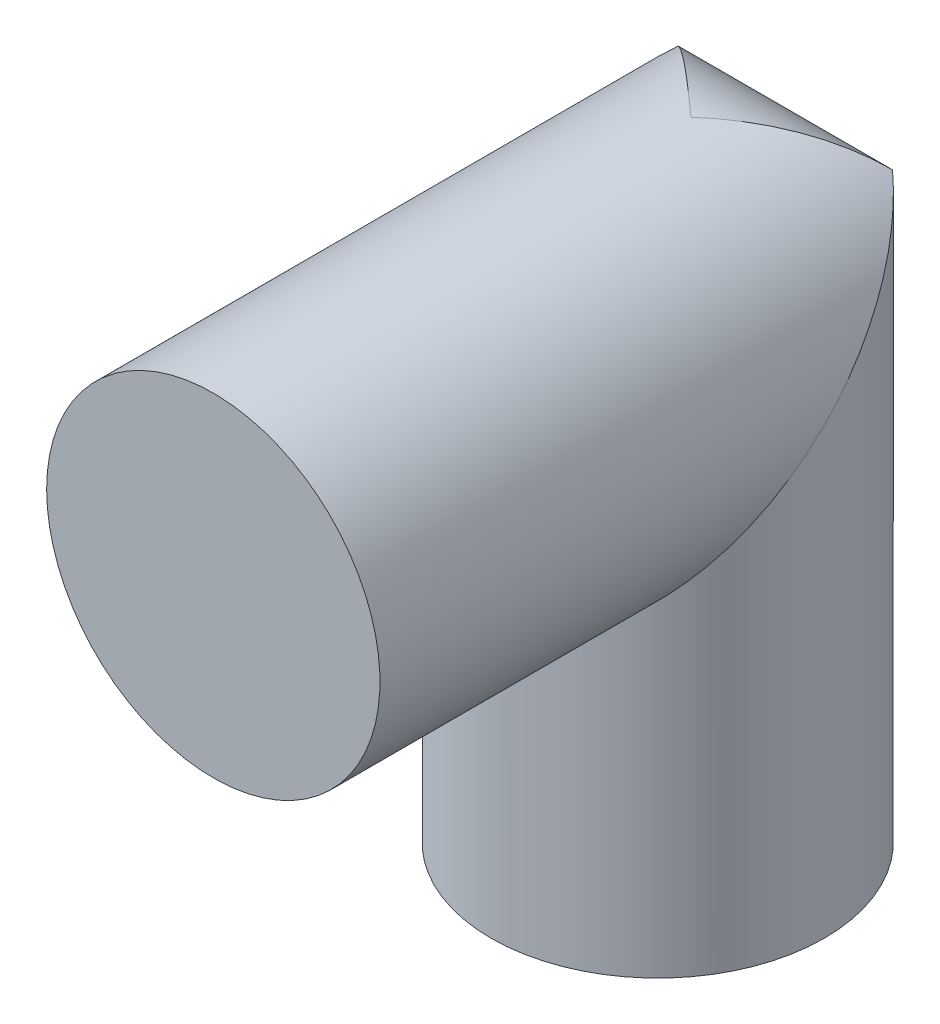
ISO-10303-21;
HEADER;
FILE_DESCRIPTION(('STEP AP214'),'2;1');
FILE_NAME('part.step','',(''),(''),'','','');
FILE_SCHEMA(('AUTOMOTIVE_DESIGN { 1 0 10303 214 1 1 1 1 }'));
ENDSEC;
DATA;
#1=APPLICATION_CONTEXT('core data for automotive mechanical design processes');
#2=APPLICATION_PROTOCOL_DEFINITION('international standard','automotive_design',2000,#1);
#3=PRODUCT_CONTEXT('',#1,'mechanical');
#4=PRODUCT('Part','Part','',(#3));
#5=PRODUCT_RELATED_PRODUCT_CATEGORY('part','',(#4));
#6=PRODUCT_DEFINITION_FORMATION('','',#4);
#7=PRODUCT_DEFINITION_CONTEXT('part definition',#1,'design');
#8=PRODUCT_DEFINITION('design','',#6,#7);
#9=PRODUCT_DEFINITION_SHAPE('','',#8);
#10=(LENGTH_UNIT() NAMED_UNIT(*) SI_UNIT(.MILLI.,.METRE.));
#11=(NAMED_UNIT(*) PLANE_ANGLE_UNIT() SI_UNIT($,.RADIAN.));
#12=(NAMED_UNIT(*) SI_UNIT($,.STERADIAN.) SOLID_ANGLE_UNIT());
#13=UNCERTAINTY_MEASURE_WITH_UNIT(LENGTH_MEASURE(1.E-05),#10,'distance_accuracy_value','');
#14=(GEOMETRIC_REPRESENTATION_CONTEXT(3) GLOBAL_UNCERTAINTY_ASSIGNED_CONTEXT((#13)) GLOBAL_UNIT_ASSIGNED_CONTEXT((#10,
#11,#12)) REPRESENTATION_CONTEXT('',''));
#15=CARTESIAN_POINT('',(0.,0.,0.));
#16=DIRECTION('',(0.,0.,1.));
#17=DIRECTION('',(1.,0.,0.));
#18=AXIS2_PLACEMENT_3D('',#15,#16,#17);
#19=CARTESIAN_POINT('',(0.,21.5,-1.5));
#20=DIRECTION('',(-1.,0.,0.));
#21=DIRECTION('',(0.,0.,-1.));
#22=AXIS2_PLACEMENT_3D('',#19,#20,#21);
#23=CYLINDRICAL_SURFACE('',#22,6.);
#24=CARTESIAN_POINT('',(-7.34846922834953,27.5,-1.5));
#25=CARTESIAN_POINT('',(-7.31706424320828,27.5000331957549,-1.65405077419429));
#26=CARTESIAN_POINT('',(-7.28075194110682,27.4940693668532,-1.80703711580767));
#27=CARTESIAN_POINT('',(-7.19892176468412,27.4708798561574,-2.10947278347154));
#28=CARTESIAN_POINT('',(-7.15341480555609,27.45366747415,-2.25892607088523));
#29=CARTESIAN_POINT('',(-7.05418509725385,27.4089160579525,-2.55190609071861));
#30=CARTESIAN_POINT('',(-7.00054159376687,27.3814732609108,-2.69547463052301));
#31=CARTESIAN_POINT('',(-6.88542259652419,27.3170929655942,-2.97726707911698));
#32=CARTESIAN_POINT('',(-6.82394500325097,27.2801529193687,-3.11548954217873));
#33=CARTESIAN_POINT('',(-6.6942220814402,27.1978725359462,-3.38521497082394));
#34=CARTESIAN_POINT('',(-6.62601154961609,27.152574435804,-3.51674765868404));
#35=CARTESIAN_POINT('',(-6.4832859756266,27.0543249800231,-3.77340449367048));
#36=CARTESIAN_POINT('',(-6.40876873452205,27.0013709504214,-3.89852638095057));
#37=CARTESIAN_POINT('',(-6.17651896919774,26.8320737340819,-4.264282989696));
#38=CARTESIAN_POINT('',(-6.01031740131606,26.7054434095421,-4.49484023103864));
#39=CARTESIAN_POINT('',(-5.56725801293658,26.3577363930378,-5.04359779603737));
#40=CARTESIAN_POINT('',(-5.27857768732249,26.1222582745337,-5.34315292990793));
#41=CARTESIAN_POINT('',(-4.82535938390804,25.7441211948374,-5.7451644420547));
#42=CARTESIAN_POINT('',(-4.67067303979472,25.6137077577687,-5.87143511792813));
#43=CARTESIAN_POINT('',(-4.35565867931801,25.3459342113691,-6.10877087768909));
#44=CARTESIAN_POINT('',(-4.19533069401521,25.2085741402817,-6.21983604527555));
#45=CARTESIAN_POINT('',(-3.80972447054179,24.8761643468941,-6.46575611994799));
#46=CARTESIAN_POINT('',(-3.58244270484609,24.6786388710023,-6.59412244217131));
#47=CARTESIAN_POINT('',(-3.12151583544015,24.275707309497,-6.82440727984441));
#48=CARTESIAN_POINT('',(-2.88786843379676,24.0702983667924,-6.92631610078327));
#49=CARTESIAN_POINT('',(-2.4162110566506,23.653977718259,-7.10460478297199));
#50=CARTESIAN_POINT('',(-2.17820522234088,23.4430711627534,-7.18100767347115));
#51=CARTESIAN_POINT('',(-1.69917689146743,23.0174626863675,-7.30919273707965));
#52=CARTESIAN_POINT('',(-1.458154709178,22.8027611599409,-7.36097745360345));
#53=CARTESIAN_POINT('',(-0.816756950161567,22.2305245219006,-7.46636698368148));
#54=CARTESIAN_POINT('',(-0.414581874794828,21.8708132487053,-7.4992978008994));
#55=CARTESIAN_POINT('',(-0.00860657087966011,21.5076979505281,-7.49999629295744));
#56=CARTESIAN_POINT('',(-0.00430325450511151,21.5038489473343,-7.49999999648203));
#57=CARTESIAN_POINT('',(0.,21.5,-7.5));
#58=B_SPLINE_CURVE_WITH_KNOTS('',3,(#24,#25,#26,#27,#28,#29,#30,#31,#32,#33,#34,#35,#36,#37,#38,
#39,#40,#41,#42,#43,#44,#45,#46,#47,#48,#49,#50,#51,#52,#53,#54,#55,#56,#57),.UNSPECIFIED.,.F.,
.F.,(4,2,2,2,2,2,2,2,2,2,2,2,2,2,2,2,4),(0.,0.471373590474039,0.942190855766601,
1.40868655153159,1.8753075310081,2.33963201979185,2.80411907530698,3.73470291513999,
5.16046403165904,5.87549295654269,6.59051794538261,7.57115182108864,8.55214451340354,
9.53224905871671,10.5122523229959,12.1289287099927,12.1462492216324),.UNSPECIFIED.);
#59=CARTESIAN_POINT('',(-4.82411421285216,25.7426406871193,-5.74264068711928));
#60=VERTEX_POINT('',#59);
#61=CARTESIAN_POINT('',(0.,21.5,-7.5));
#62=VERTEX_POINT('',#61);
#63=EDGE_CURVE('E76',#60,#62,#58,.T.);
#64=ORIENTED_EDGE('',*,*,#63,.F.);
#65=CARTESIAN_POINT('',(-7.34846922834954,21.5,-7.5));
#66=CARTESIAN_POINT('',(-7.31706424320828,21.6540507741943,-7.50003319575489));
#67=CARTESIAN_POINT('',(-7.28075194110682,21.8070371158077,-7.49406936685315));
#68=CARTESIAN_POINT('',(-7.19892176468412,22.1094727834715,-7.47087985615743));
#69=CARTESIAN_POINT('',(-7.15341480555609,22.2589260708852,-7.45366747414996));
#70=CARTESIAN_POINT('',(-7.05418509725386,22.5519060907186,-7.40891605795252));
#71=CARTESIAN_POINT('',(-7.00054159376687,22.695474630523,-7.38147326091079));
#72=CARTESIAN_POINT('',(-6.88542259652419,22.977267079117,-7.31709296559424));
#73=CARTESIAN_POINT('',(-6.82394500325097,23.1154895421787,-7.2801529193687));
#74=CARTESIAN_POINT('',(-6.69422208144019,23.3852149708239,-7.19787253594618));
#75=CARTESIAN_POINT('',(-6.62601154961609,23.516747658684,-7.15257443580398));
#76=CARTESIAN_POINT('',(-6.48328597562659,23.7734044936705,-7.0543249800231));
#77=CARTESIAN_POINT('',(-6.40876873452205,23.8985263809506,-7.00137095042142));
#78=CARTESIAN_POINT('',(-6.17651896919773,24.264282989696,-6.83207373408186));
#79=CARTESIAN_POINT('',(-6.01031740131606,24.4948402310386,-6.70544340954208));
#80=CARTESIAN_POINT('',(-5.56725801293659,25.0435977960374,-6.35773639303777));
#81=CARTESIAN_POINT('',(-5.2785776873225,25.3431529299079,-6.12225827453367));
#82=CARTESIAN_POINT('',(-4.82535938390806,25.7451644420547,-5.74412119483743));
#83=CARTESIAN_POINT('',(-4.67067303979474,25.8714351179281,-5.61370775776872));
#84=CARTESIAN_POINT('',(-4.35565867931802,26.1087708776891,-5.34593421136909));
#85=CARTESIAN_POINT('',(-4.19533069401521,26.2198360452755,-5.20857414028169));
#86=CARTESIAN_POINT('',(-3.80972447054179,26.465756119948,-4.87616434689405));
#87=CARTESIAN_POINT('',(-3.58244270484611,26.5941224421713,-4.67863887100232));
#88=CARTESIAN_POINT('',(-3.12151583544012,26.8244072798444,-4.275707309497));
#89=CARTESIAN_POINT('',(-2.88786843379666,26.9263161007833,-4.07029836679249));
#90=CARTESIAN_POINT('',(-2.41621105665066,27.104604782972,-3.65397771825885));
#91=CARTESIAN_POINT('',(-2.17820522234116,27.1810076734712,-3.44307116275308));
#92=CARTESIAN_POINT('',(-1.69917689146713,27.3091927370797,-3.01746268636787));
#93=CARTESIAN_POINT('',(-1.45815470917688,27.3609774536035,-2.80276115994216));
#94=CARTESIAN_POINT('',(-0.81675695016343,27.4663669836815,-2.23052452189857));
#95=CARTESIAN_POINT('',(-0.414581874803825,27.4992978008993,-1.87081324869521));
#96=CARTESIAN_POINT('',(-0.00860657087985405,27.4999962929574,-1.50769795052791));
#97=CARTESIAN_POINT('',(-0.00430325450520941,27.499999996482,-1.50384894733419));
#98=CARTESIAN_POINT('',(0.,27.5,-1.5));
#99=B_SPLINE_CURVE_WITH_KNOTS('',3,(#65,#66,#67,#68,#69,#70,#71,#72,#73,#74,#75,#76,#77,#78,#79,
#80,#81,#82,#83,#84,#85,#86,#87,#88,#89,#90,#91,#92,#93,#94,#95,#96,#97,#98),.UNSPECIFIED.,.F.,
.F.,(4,2,2,2,2,2,2,2,2,2,2,2,2,2,2,2,4),(0.,0.471373590474027,0.942190855766583,
1.40868655153158,1.8753075310081,2.33963201979186,2.80411907530699,3.73470291513999,
5.16046403165901,5.87549295654268,6.59051794538261,7.57115182108865,8.55214451340358,
9.53224905871674,10.5122523229959,12.1289287099927,12.1462492216324),.UNSPECIFIED.);
#100=CARTESIAN_POINT('',(0.,27.5,-1.5));
#101=VERTEX_POINT('',#100);
#102=EDGE_CURVE('E65',#101,#60,#99,.F.);
#103=ORIENTED_EDGE('',*,*,#102,.F.);
#104=CARTESIAN_POINT('',(7.34846922834954,21.5,-7.5));
#105=CARTESIAN_POINT('',(7.31706424320828,21.6540507741943,-7.50003319575489));
#106=CARTESIAN_POINT('',(7.28075194110682,21.8070371158077,-7.49406936685315));
#107=CARTESIAN_POINT('',(7.19892176468412,22.1094727834715,-7.47087985615743));
#108=CARTESIAN_POINT('',(7.15341480555609,22.2589260708852,-7.45366747414996));
#109=CARTESIAN_POINT('',(7.05418509725386,22.5519060907186,-7.40891605795252));
#110=CARTESIAN_POINT('',(7.00054159376687,22.695474630523,-7.38147326091079));
#111=CARTESIAN_POINT('',(6.88542259652419,22.977267079117,-7.31709296559424));
#112=CARTESIAN_POINT('',(6.82394500325097,23.1154895421787,-7.2801529193687));
#113=CARTESIAN_POINT('',(6.69422208144019,23.3852149708239,-7.19787253594618));
#114=CARTESIAN_POINT('',(6.62601154961609,23.516747658684,-7.15257443580398));
#115=CARTESIAN_POINT('',(6.48328597562659,23.7734044936705,-7.0543249800231));
#116=CARTESIAN_POINT('',(6.40876873452205,23.8985263809506,-7.00137095042142));
#117=CARTESIAN_POINT('',(6.17651896919773,24.264282989696,-6.83207373408186));
#118=CARTESIAN_POINT('',(6.01031740131606,24.4948402310386,-6.70544340954208));
#119=CARTESIAN_POINT('',(5.56725801293659,25.0435977960374,-6.35773639303777));
#120=CARTESIAN_POINT('',(5.2785776873225,25.3431529299079,-6.12225827453367));
#121=CARTESIAN_POINT('',(4.82535938390806,25.7451644420547,-5.74412119483743));
#122=CARTESIAN_POINT('',(4.67067303979474,25.8714351179281,-5.61370775776872));
#123=CARTESIAN_POINT('',(4.35565867931802,26.1087708776891,-5.34593421136909));
#124=CARTESIAN_POINT('',(4.19533069401521,26.2198360452755,-5.20857414028169));
#125=CARTESIAN_POINT('',(3.80972447054179,26.465756119948,-4.87616434689405));
#126=CARTESIAN_POINT('',(3.58244270484611,26.5941224421713,-4.67863887100232));
#127=CARTESIAN_POINT('',(3.12151583544012,26.8244072798444,-4.275707309497));
#128=CARTESIAN_POINT('',(2.88786843379666,26.9263161007833,-4.07029836679249));
#129=CARTESIAN_POINT('',(2.41621105665066,27.104604782972,-3.65397771825885));
#130=CARTESIAN_POINT('',(2.17820522234116,27.1810076734712,-3.44307116275308));
#131=CARTESIAN_POINT('',(1.69917689146713,27.3091927370797,-3.01746268636787));
#132=CARTESIAN_POINT('',(1.45815470917688,27.3609774536035,-2.80276115994216));
#133=CARTESIAN_POINT('',(0.81675695016343,27.4663669836815,-2.23052452189857));
#134=CARTESIAN_POINT('',(0.414581874803825,27.4992978008993,-1.87081324869521));
#135=CARTESIAN_POINT('',(0.00860657087985405,27.4999962929574,-1.50769795052791));
#136=CARTESIAN_POINT('',(0.00430325450520941,27.499999996482,-1.50384894733419));
#137=CARTESIAN_POINT('',(0.,27.5,-1.5));
#138=B_SPLINE_CURVE_WITH_KNOTS('',3,(#104,#105,#106,#107,#108,#109,#110,#111,#112,#113,#114,
#115,#116,#117,#118,#119,#120,#121,#122,#123,#124,#125,#126,#127,#128,#129,#130,#131,#132,#133,
#134,#135,#136,#137),.UNSPECIFIED.,.F.,.F.,(4,2,2,2,2,2,2,2,2,2,2,2,2,2,2,2,4),(0.,
0.471373590474027,0.942190855766583,1.40868655153158,1.8753075310081,2.33963201979186,
2.80411907530699,3.73470291513999,5.16046403165901,5.87549295654268,6.59051794538261,
7.57115182108865,8.55214451340358,9.53224905871674,10.5122523229959,12.1289287099927,
12.1462492216324),.UNSPECIFIED.);
#139=CARTESIAN_POINT('',(4.82411421285216,25.7426406871193,-5.74264068711928));
#140=VERTEX_POINT('',#139);
#141=EDGE_CURVE('E39',#101,#140,#138,.F.);
#142=ORIENTED_EDGE('',*,*,#141,.T.);
#143=CARTESIAN_POINT('',(7.34846922834953,27.5,-1.5));
#144=CARTESIAN_POINT('',(7.31706424320828,27.5000331957549,-1.65405077419429));
#145=CARTESIAN_POINT('',(7.28075194110682,27.4940693668532,-1.80703711580767));
#146=CARTESIAN_POINT('',(7.19892176468412,27.4708798561574,-2.10947278347154));
#147=CARTESIAN_POINT('',(7.15341480555609,27.45366747415,-2.25892607088523));
#148=CARTESIAN_POINT('',(7.05418509725385,27.4089160579525,-2.55190609071861));
#149=CARTESIAN_POINT('',(7.00054159376687,27.3814732609108,-2.69547463052301));
#150=CARTESIAN_POINT('',(6.88542259652419,27.3170929655942,-2.97726707911698));
#151=CARTESIAN_POINT('',(6.82394500325097,27.2801529193687,-3.11548954217873));
#152=CARTESIAN_POINT('',(6.6942220814402,27.1978725359462,-3.38521497082394));
#153=CARTESIAN_POINT('',(6.62601154961609,27.152574435804,-3.51674765868404));
#154=CARTESIAN_POINT('',(6.4832859756266,27.0543249800231,-3.77340449367048));
#155=CARTESIAN_POINT('',(6.40876873452205,27.0013709504214,-3.89852638095057));
#156=CARTESIAN_POINT('',(6.17651896919774,26.8320737340819,-4.264282989696));
#157=CARTESIAN_POINT('',(6.01031740131606,26.7054434095421,-4.49484023103864));
#158=CARTESIAN_POINT('',(5.56725801293658,26.3577363930378,-5.04359779603737));
#159=CARTESIAN_POINT('',(5.27857768732249,26.1222582745337,-5.34315292990793));
#160=CARTESIAN_POINT('',(4.82535938390804,25.7441211948374,-5.7451644420547));
#161=CARTESIAN_POINT('',(4.67067303979472,25.6137077577687,-5.87143511792813));
#162=CARTESIAN_POINT('',(4.35565867931801,25.3459342113691,-6.10877087768909));
#163=CARTESIAN_POINT('',(4.19533069401521,25.2085741402817,-6.21983604527555));
#164=CARTESIAN_POINT('',(3.80972447054179,24.8761643468941,-6.46575611994799));
#165=CARTESIAN_POINT('',(3.58244270484609,24.6786388710023,-6.59412244217131));
#166=CARTESIAN_POINT('',(3.12151583544015,24.275707309497,-6.82440727984441));
#167=CARTESIAN_POINT('',(2.88786843379676,24.0702983667924,-6.92631610078327));
#168=CARTESIAN_POINT('',(2.4162110566506,23.653977718259,-7.10460478297199));
#169=CARTESIAN_POINT('',(2.17820522234088,23.4430711627534,-7.18100767347115));
#170=CARTESIAN_POINT('',(1.69917689146743,23.0174626863675,-7.30919273707965));
#171=CARTESIAN_POINT('',(1.458154709178,22.8027611599409,-7.36097745360345));
#172=CARTESIAN_POINT('',(0.816756950161567,22.2305245219006,-7.46636698368148));
#173=CARTESIAN_POINT('',(0.414581874794828,21.8708132487053,-7.4992978008994));
#174=CARTESIAN_POINT('',(0.00860657087966011,21.5076979505281,-7.49999629295744));
#175=CARTESIAN_POINT('',(0.00430325450511151,21.5038489473343,-7.49999999648203));
#176=CARTESIAN_POINT('',(0.,21.5,-7.5));
#177=B_SPLINE_CURVE_WITH_KNOTS('',3,(#143,#144,#145,#146,#147,#148,#149,#150,#151,#152,#153,
#154,#155,#156,#157,#158,#159,#160,#161,#162,#163,#164,#165,#166,#167,#168,#169,#170,#171,#172,
#173,#174,#175,#176),.UNSPECIFIED.,.F.,.F.,(4,2,2,2,2,2,2,2,2,2,2,2,2,2,2,2,4),(0.,
0.471373590474039,0.942190855766601,1.40868655153159,1.8753075310081,2.33963201979185,
2.80411907530698,3.73470291513999,5.16046403165904,5.87549295654269,6.59051794538261,
7.57115182108864,8.55214451340354,9.53224905871671,10.5122523229959,12.1289287099927,
12.1462492216324),.UNSPECIFIED.);
#178=EDGE_CURVE('E73',#140,#62,#177,.T.);
#179=ORIENTED_EDGE('',*,*,#178,.T.);
#180=EDGE_LOOP('',(#64,#103,#142,#179));
#181=FACE_BOUND('',#180,.T.);
#182=ADVANCED_FACE('F35',(#181),#23,.T.);
#183=CARTESIAN_POINT('',(0.,20.,20.));
#184=DIRECTION('',(0.,0.,1.));
#185=DIRECTION('',(-1.,0.,0.));
#186=AXIS2_PLACEMENT_3D('',#183,#184,#185);
#187=PLANE('',#186);
#188=CARTESIAN_POINT('',(0.,20.,20.));
#189=DIRECTION('',(0.,0.,-1.));
#190=DIRECTION('',(-1.,0.,0.));
#191=AXIS2_PLACEMENT_3D('',#188,#189,#190);
#192=CIRCLE('',#191,7.5);
#193=CARTESIAN_POINT('',(-7.5,20.,20.));
#194=VERTEX_POINT('',#193);
#195=EDGE_CURVE('E71',#194,#194,#192,.T.);
#196=ORIENTED_EDGE('',*,*,#195,.F.);
#197=EDGE_LOOP('',(#196));
#198=FACE_BOUND('',#197,.T.);
#199=ADVANCED_FACE('F100',(#198),#187,.T.);
#200=CARTESIAN_POINT('',(0.,20.,0.));
#201=DIRECTION('',(0.,0.,1.));
#202=DIRECTION('',(-1.,0.,0.));
#203=AXIS2_PLACEMENT_3D('',#200,#201,#202);
#204=CYLINDRICAL_SURFACE('',#203,7.5);
#205=ORIENTED_EDGE('',*,*,#141,.F.);
#206=ORIENTED_EDGE('',*,*,#102,.T.);
#207=CARTESIAN_POINT('',(0.,20.,0.));
#208=DIRECTION('',(0.,0.707106781186547,0.707106781186547));
#209=DIRECTION('',(0.,-0.707106781186547,0.707106781186547));
#210=AXIS2_PLACEMENT_3D('',#207,#208,#209);
#211=ELLIPSE('',#210,10.6066017177982,7.5);
#212=EDGE_CURVE('E48',#60,#140,#211,.T.);
#213=ORIENTED_EDGE('',*,*,#212,.T.);
#214=EDGE_LOOP('',(#205,#206,#213));
#215=FACE_BOUND('',#214,.T.);
#216=ORIENTED_EDGE('',*,*,#195,.T.);
#217=EDGE_LOOP('',(#216));
#218=FACE_BOUND('',#217,.T.);
#219=ADVANCED_FACE('F68',(#215,#218),#204,.T.);
#220=CARTESIAN_POINT('',(0.,0.,0.));
#221=DIRECTION('',(0.,1.,0.));
#222=DIRECTION('',(0.,0.,1.));
#223=AXIS2_PLACEMENT_3D('',#220,#221,#222);
#224=PLANE('',#223);
#225=CARTESIAN_POINT('',(0.,0.,0.));
#226=DIRECTION('',(0.,-1.,0.));
#227=DIRECTION('',(0.,0.,1.));
#228=AXIS2_PLACEMENT_3D('',#225,#226,#227);
#229=CIRCLE('',#228,7.5);
#230=CARTESIAN_POINT('',(0.,0.,7.5));
#231=VERTEX_POINT('',#230);
#232=EDGE_CURVE('E11',#231,#231,#229,.T.);
#233=ORIENTED_EDGE('',*,*,#232,.T.);
#234=EDGE_LOOP('',(#233));
#235=FACE_BOUND('',#234,.T.);
#236=ADVANCED_FACE('F121',(#235),#224,.F.);
#237=CARTESIAN_POINT('',(0.,20.,0.));
#238=DIRECTION('',(0.,-1.,0.));
#239=DIRECTION('',(0.,0.,-1.));
#240=AXIS2_PLACEMENT_3D('',#237,#238,#239);
#241=CYLINDRICAL_SURFACE('',#240,7.5);
#242=ORIENTED_EDGE('',*,*,#232,.F.);
#243=EDGE_LOOP('',(#242));
#244=FACE_BOUND('',#243,.T.);
#245=ORIENTED_EDGE('',*,*,#212,.F.);
#246=ORIENTED_EDGE('',*,*,#63,.T.);
#247=ORIENTED_EDGE('',*,*,#178,.F.);
#248=EDGE_LOOP('',(#245,#246,#247));
#249=FACE_BOUND('',#248,.T.);
#250=ADVANCED_FACE('F75',(#244,#249),#241,.T.);
#251=CLOSED_SHELL('',(#182,#199,#219,#236,#250));
#252=MANIFOLD_SOLID_BREP('B2',#251);
#253=ADVANCED_BREP_SHAPE_REPRESENTATION('',(#18,#252),#14);
#254=SHAPE_DEFINITION_REPRESENTATION(#9,#253);
ENDSEC;
END-ISO-10303-21;
